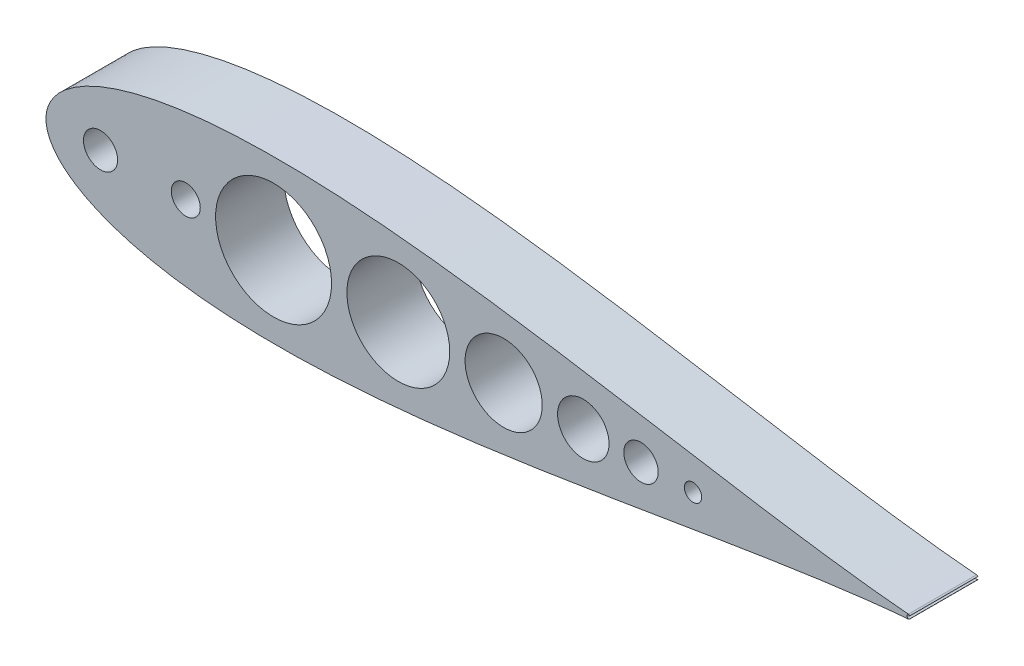
ISO-10303-21;
HEADER;
FILE_DESCRIPTION(('STEP AP214'),'2;1');
FILE_NAME('part.step','',(''),(''),'','','');
FILE_SCHEMA(('AUTOMOTIVE_DESIGN { 1 0 10303 214 1 1 1 1 }'));
ENDSEC;
DATA;
#1=APPLICATION_CONTEXT('core data for automotive mechanical design processes');
#2=APPLICATION_PROTOCOL_DEFINITION('international standard','automotive_design',2000,#1);
#3=PRODUCT_CONTEXT('',#1,'mechanical');
#4=PRODUCT('Part','Part','',(#3));
#5=PRODUCT_RELATED_PRODUCT_CATEGORY('part','',(#4));
#6=PRODUCT_DEFINITION_FORMATION('','',#4);
#7=PRODUCT_DEFINITION_CONTEXT('part definition',#1,'design');
#8=PRODUCT_DEFINITION('design','',#6,#7);
#9=PRODUCT_DEFINITION_SHAPE('','',#8);
#10=(LENGTH_UNIT() NAMED_UNIT(*) SI_UNIT(.MILLI.,.METRE.));
#11=(NAMED_UNIT(*) PLANE_ANGLE_UNIT() SI_UNIT($,.RADIAN.));
#12=(NAMED_UNIT(*) SI_UNIT($,.STERADIAN.) SOLID_ANGLE_UNIT());
#13=UNCERTAINTY_MEASURE_WITH_UNIT(LENGTH_MEASURE(1.E-05),#10,'distance_accuracy_value','');
#14=(GEOMETRIC_REPRESENTATION_CONTEXT(3) GLOBAL_UNCERTAINTY_ASSIGNED_CONTEXT((#13)) GLOBAL_UNIT_ASSIGNED_CONTEXT((#10,
#11,#12)) REPRESENTATION_CONTEXT('',''));
#15=CARTESIAN_POINT('',(0.,0.,0.));
#16=DIRECTION('',(0.,0.,1.));
#17=DIRECTION('',(1.,0.,0.));
#18=AXIS2_PLACEMENT_3D('',#15,#16,#17);
#19=CARTESIAN_POINT('',(670.559999999999,0.,50.7999999999997));
#20=CARTESIAN_POINT('',(670.559999999999,0.015678594926758,50.7999999999997));
#21=CARTESIAN_POINT('',(666.344759682884,0.0546967077379723,50.7999999999997));
#22=CARTESIAN_POINT('',(662.850933167966,0.234427605388388,50.7999999999997));
#23=CARTESIAN_POINT('',(656.504964310748,0.543558382914533,50.7999999999997));
#24=CARTESIAN_POINT('',(649.29295176402,1.03477125279453,50.7999999999997));
#25=CARTESIAN_POINT('',(640.49155963975,1.7319195784182,50.7999999999997));
#26=CARTESIAN_POINT('',(630.413817461935,2.66338549322032,50.7999999999997));
#27=CARTESIAN_POINT('',(619.014124193101,3.8492536640852,50.7999999999997));
#28=CARTESIAN_POINT('',(606.374988512379,5.30442898343114,50.7999999999997));
#29=CARTESIAN_POINT('',(592.543922516217,7.03763490710044,50.7999999999997));
#30=CARTESIAN_POINT('',(577.585454095337,9.05063614704171,50.7999999999997));
#31=CARTESIAN_POINT('',(561.564270734498,11.3389196249111,50.7999999999997));
#32=CARTESIAN_POINT('',(544.549749945782,13.890665374914,50.7999999999997));
#33=CARTESIAN_POINT('',(526.614143657614,16.6877207529689,50.7999999999997));
#34=CARTESIAN_POINT('',(507.832591566438,19.7051116629439,50.7999999999997));
#35=CARTESIAN_POINT('',(488.28271028846,22.9116726009049,50.7999999999997));
#36=CARTESIAN_POINT('',(468.04436773457,26.2704360601483,50.7999999999997));
#37=CARTESIAN_POINT('',(447.199424328287,29.7390074319527,50.7999999999997));
#38=CARTESIAN_POINT('',(425.831595832133,33.2703241206413,50.7999999999997));
#39=CARTESIAN_POINT('',(404.026315660115,36.8132205450789,50.7999999999997));
#40=CARTESIAN_POINT('',(381.870662855574,40.3132668564463,50.7999999999997));
#41=CARTESIAN_POINT('',(359.45331489519,43.7135025323023,50.7999999999997));
#42=CARTESIAN_POINT('',(336.864544150043,46.9554474567625,50.7999999999997));
#43=CARTESIAN_POINT('',(314.196207315012,49.9798438951445,50.7999999999997));
#44=CARTESIAN_POINT('',(291.541767703989,52.7277127038915,50.7999999999997));
#45=CARTESIAN_POINT('',(268.996310773138,55.1412010116264,50.7999999999997));
#46=CARTESIAN_POINT('',(246.656558649997,57.1646038288049,50.7999999999997));
#47=CARTESIAN_POINT('',(224.620860897201,58.7451766411795,50.7999999999997));
#48=CARTESIAN_POINT('',(202.989192599403,59.8341217002376,50.7999999999997));
#49=CARTESIAN_POINT('',(181.863132616042,60.3875061421198,50.7999999999997));
#50=CARTESIAN_POINT('',(161.345829026568,60.3669613241371,50.7999999999997));
#51=CARTESIAN_POINT('',(141.542033827972,59.7398958243376,50.7999999999997));
#52=CARTESIAN_POINT('',(122.558104572901,58.4817581038393,50.7999999999997));
#53=CARTESIAN_POINT('',(104.502313427195,56.5743039322431,50.7999999999997));
#54=CARTESIAN_POINT('',(87.4850186361544,54.0089351991652,50.7999999999997));
#55=CARTESIAN_POINT('',(71.6196960831897,50.7847520029955,50.7999999999997));
#56=CARTESIAN_POINT('',(57.0237097246997,46.9125430655856,50.7999999999997));
#57=CARTESIAN_POINT('',(43.8204543300274,42.4150024601014,50.7999999999997));
#58=CARTESIAN_POINT('',(32.1416452388822,37.332204028646,50.7999999999997));
#59=CARTESIAN_POINT('',(22.1291073753192,31.7314553388244,50.7999999999997));
#60=CARTESIAN_POINT('',(13.932423523913,25.7264121059534,50.7999999999997));
#61=CARTESIAN_POINT('',(7.68961648909829,19.5132076319134,50.7999999999997));
#62=CARTESIAN_POINT('',(3.46313634309123,13.4203544206608,50.7999999999997));
#63=CARTESIAN_POINT('',(1.10633322756691,7.92338943472258,50.7999999999997));
#64=CARTESIAN_POINT('',(0.154611581573635,3.51379661507278,50.7999999999997));
#65=CARTESIAN_POINT('',(-0.0621515976067938,1.11022302462516E-13,50.7999999999997));
#66=CARTESIAN_POINT('',(0.154611581573594,-3.51379661507323,50.7999999999997));
#67=CARTESIAN_POINT('',(1.10633322756683,-7.92338943472273,50.7999999999997));
#68=CARTESIAN_POINT('',(3.46313634309116,-13.4203544206611,50.7999999999997));
#69=CARTESIAN_POINT('',(7.68961648909822,-19.5132076319135,50.7999999999997));
#70=CARTESIAN_POINT('',(13.932423523913,-25.7264121059536,50.7999999999997));
#71=CARTESIAN_POINT('',(22.1291073753193,-31.7314553388246,50.7999999999997));
#72=CARTESIAN_POINT('',(32.141645238882,-37.3322040286461,50.7999999999997));
#73=CARTESIAN_POINT('',(43.8204543300276,-42.4150024601016,50.7999999999997));
#74=CARTESIAN_POINT('',(57.0237097246996,-46.9125430655858,50.7999999999997));
#75=CARTESIAN_POINT('',(71.6196960831898,-50.7847520029957,50.7999999999997));
#76=CARTESIAN_POINT('',(87.4850186361543,-54.0089351991654,50.7999999999997));
#77=CARTESIAN_POINT('',(104.502313427195,-56.5743039322433,50.7999999999997));
#78=CARTESIAN_POINT('',(122.558104572901,-58.4817581038393,50.7999999999997));
#79=CARTESIAN_POINT('',(141.542033827972,-59.7398958243377,50.7999999999997));
#80=CARTESIAN_POINT('',(161.345829026568,-60.366961324137,50.7999999999997));
#81=CARTESIAN_POINT('',(181.863132616042,-60.38750614212,50.7999999999997));
#82=CARTESIAN_POINT('',(202.989192599403,-59.8341217002377,50.7999999999997));
#83=CARTESIAN_POINT('',(224.6208608972,-58.7451766411795,50.7999999999997));
#84=CARTESIAN_POINT('',(246.656558649997,-57.1646038288049,50.7999999999997));
#85=CARTESIAN_POINT('',(268.996310773137,-55.1412010116263,50.7999999999997));
#86=CARTESIAN_POINT('',(291.541767703989,-52.7277127038914,50.7999999999997));
#87=CARTESIAN_POINT('',(314.196207315012,-49.9798438951445,50.7999999999997));
#88=CARTESIAN_POINT('',(336.864544150043,-46.9554474567625,50.7999999999997));
#89=CARTESIAN_POINT('',(359.45331489519,-43.7135025323023,50.7999999999997));
#90=CARTESIAN_POINT('',(381.870662855574,-40.3132668564459,50.7999999999997));
#91=CARTESIAN_POINT('',(404.026315660115,-36.8132205450789,50.7999999999997));
#92=CARTESIAN_POINT('',(425.831595832133,-33.2703241206413,50.7999999999997));
#93=CARTESIAN_POINT('',(447.199424328287,-29.7390074319527,50.7999999999997));
#94=CARTESIAN_POINT('',(468.04436773457,-26.2704360601484,50.7999999999997));
#95=CARTESIAN_POINT('',(488.28271028846,-22.911672600905,50.7999999999997));
#96=CARTESIAN_POINT('',(507.832591566438,-19.7051116629441,50.7999999999997));
#97=CARTESIAN_POINT('',(526.614143657613,-16.687720752969,50.7999999999997));
#98=CARTESIAN_POINT('',(544.549749945782,-13.8906653749145,50.7999999999997));
#99=CARTESIAN_POINT('',(561.564270734499,-11.3389196249109,50.7999999999997));
#100=CARTESIAN_POINT('',(577.585454095336,-9.05063614704174,50.7999999999997));
#101=CARTESIAN_POINT('',(592.543922516216,-7.03763490710049,50.7999999999997));
#102=CARTESIAN_POINT('',(606.37498851238,-5.3044289834312,50.7999999999997));
#103=CARTESIAN_POINT('',(619.014124193101,-3.84925366408523,50.7999999999997));
#104=CARTESIAN_POINT('',(630.413817461935,-2.66338549322043,50.7999999999997));
#105=CARTESIAN_POINT('',(640.491559639751,-1.73191957841817,50.7999999999997));
#106=CARTESIAN_POINT('',(649.29295176402,-1.03477125279466,50.7999999999997));
#107=CARTESIAN_POINT('',(656.504964310748,-0.543558382914894,50.7999999999997));
#108=CARTESIAN_POINT('',(662.850933167966,-0.234427605388915,50.7999999999997));
#109=CARTESIAN_POINT('',(666.344759682884,-0.0546967077380001,50.7999999999997));
#110=CARTESIAN_POINT('',(670.559999999999,-0.0156785949268456,50.7999999999997));
#111=CARTESIAN_POINT('',(670.559999999999,0.,50.7999999999997));
#112=B_SPLINE_CURVE_WITH_KNOTS('',3,(#19,#20,#21,#22,#23,#24,#25,#26,#27,#28,#29,#30,#31,#32,
#33,#34,#35,#36,#37,#38,#39,#40,#41,#42,#43,#44,#45,#46,#47,#48,#49,#50,#51,#52,#53,#54,#55,#56,
#57,#58,#59,#60,#61,#62,#63,#64,#65,#66,#67,#68,#69,#70,#71,#72,#73,#74,#75,#76,#77,#78,#79,#80,
#81,#82,#83,#84,#85,#86,#87,#88,#89,#90,#91,#92,#93,#94,#95,#96,#97,#98,#99,#100,#101,#102,#103,
#104,#105,#106,#107,#108,#109,#110,#111),.UNSPECIFIED.,.T.,.F.,(4,1,1,1,1,1,1,1,1,1,1,1,1,1,1,1,
1,1,1,1,1,1,1,1,1,1,1,1,1,1,1,1,1,1,1,1,1,1,1,1,1,1,1,1,1,1,1,1,1,1,1,1,1,1,1,1,1,1,1,1,1,1,1,1,
1,1,1,1,1,1,1,1,1,1,1,1,1,1,1,1,1,1,1,1,1,1,1,1,1,1,4),(0.,0.00216777795588342,
0.00539478220000884,0.00966720698444134,0.0149667883303173,0.0212708876900959,
0.0285525550130683,0.0367806836725549,0.0459201019032637,0.0559317636633187,0.0667728836144854,
0.0783971303496518,0.0907548266908363,0.103793164577546,0.117456431914319,0.131686225652521,
0.146421738497113,0.161599998000845,0.177156132626574,0.193023668070302,0.209134785631037,
0.225420632511523,0.241811601924249,0.258237646860869,0.274628556698349,0.290914287398014,
0.307025228908797,0.322892517177238,0.33844834182358,0.353626206573582,0.368361231970712,
0.382590427827798,0.396252960572084,0.40929041186716,0.421647009590256,0.433269881487031,
0.444109248914041,0.454118639688981,0.463255054987312,0.471479113777303,0.478755288570903,
0.485052318112802,0.490344025694165,0.494609832614287,0.497833231437255,0.5,0.502166768562745,
0.505390167385713,0.509655974305835,0.514947681887198,0.521244711429097,0.528520886222697,
0.536744945012688,0.545881360311019,0.555890751085959,0.566730118512969,0.578352990409744,
0.59070958813284,0.603747039427916,0.617409572172202,0.631638768029288,0.646373793426418,
0.66155165817642,0.677107482822761,0.692974771091203,0.709085712601986,0.725371443301651,
0.741762353139131,0.758188398075751,0.774579367488477,0.790865214368963,0.806976331929698,
0.822843867373426,0.838400001999155,0.853578261502887,0.868313774347479,0.882543568085681,
0.896206835422454,0.909245173309164,0.921602869650348,0.933227116385514,0.944068236336681,
0.954079898096736,0.963219316327445,0.971447444986932,0.978729112309904,0.985033211669683,
0.990332793015559,0.994605217799991,0.997832222044117,1.),.UNSPECIFIED.);
#113=DIRECTION('',(0.,0.,-1.));
#114=VECTOR('',#113,1.);
#115=SURFACE_OF_LINEAR_EXTRUSION('',#112,#114);
#116=CARTESIAN_POINT('',(670.559999999999,0.,0.));
#117=CARTESIAN_POINT('',(670.559999999999,0.015678594926758,0.));
#118=CARTESIAN_POINT('',(666.344759682884,0.0546967077379723,0.));
#119=CARTESIAN_POINT('',(662.850933167966,0.234427605388388,0.));
#120=CARTESIAN_POINT('',(656.504964310748,0.543558382914533,0.));
#121=CARTESIAN_POINT('',(649.29295176402,1.03477125279453,0.));
#122=CARTESIAN_POINT('',(640.49155963975,1.7319195784182,0.));
#123=CARTESIAN_POINT('',(630.413817461935,2.66338549322032,0.));
#124=CARTESIAN_POINT('',(619.014124193101,3.8492536640852,0.));
#125=CARTESIAN_POINT('',(606.374988512379,5.30442898343114,0.));
#126=CARTESIAN_POINT('',(592.543922516217,7.03763490710044,0.));
#127=CARTESIAN_POINT('',(577.585454095337,9.05063614704171,0.));
#128=CARTESIAN_POINT('',(561.564270734498,11.3389196249111,0.));
#129=CARTESIAN_POINT('',(544.549749945782,13.890665374914,0.));
#130=CARTESIAN_POINT('',(526.614143657614,16.6877207529689,0.));
#131=CARTESIAN_POINT('',(507.832591566438,19.7051116629439,0.));
#132=CARTESIAN_POINT('',(488.28271028846,22.9116726009049,0.));
#133=CARTESIAN_POINT('',(468.04436773457,26.2704360601483,0.));
#134=CARTESIAN_POINT('',(447.199424328287,29.7390074319527,0.));
#135=CARTESIAN_POINT('',(425.831595832133,33.2703241206413,0.));
#136=CARTESIAN_POINT('',(404.026315660115,36.8132205450789,0.));
#137=CARTESIAN_POINT('',(381.870662855574,40.3132668564463,0.));
#138=CARTESIAN_POINT('',(359.45331489519,43.7135025323023,0.));
#139=CARTESIAN_POINT('',(336.864544150043,46.9554474567625,0.));
#140=CARTESIAN_POINT('',(314.196207315012,49.9798438951445,0.));
#141=CARTESIAN_POINT('',(291.541767703989,52.7277127038915,0.));
#142=CARTESIAN_POINT('',(268.996310773138,55.1412010116264,0.));
#143=CARTESIAN_POINT('',(246.656558649997,57.1646038288049,0.));
#144=CARTESIAN_POINT('',(224.6208608972,58.7451766411796,0.));
#145=CARTESIAN_POINT('',(202.989192599403,59.8341217002378,0.));
#146=CARTESIAN_POINT('',(181.863132616042,60.38750614212,0.));
#147=CARTESIAN_POINT('',(161.345829026567,60.3669613241369,0.));
#148=CARTESIAN_POINT('',(141.542033827972,59.7398958243375,0.));
#149=CARTESIAN_POINT('',(122.558104572901,58.4817581038392,0.));
#150=CARTESIAN_POINT('',(104.502313427195,56.5743039322431,0.));
#151=CARTESIAN_POINT('',(87.4850186361545,54.0089351991652,0.));
#152=CARTESIAN_POINT('',(71.6196960831898,50.7847520029956,0.));
#153=CARTESIAN_POINT('',(57.0237097246998,46.9125430655857,0.));
#154=CARTESIAN_POINT('',(43.8204543300276,42.4150024601015,0.));
#155=CARTESIAN_POINT('',(32.1416452388822,37.332204028646,0.));
#156=CARTESIAN_POINT('',(22.1291073753192,31.7314553388243,0.));
#157=CARTESIAN_POINT('',(13.932423523913,25.7264121059534,0.));
#158=CARTESIAN_POINT('',(7.68961648909831,19.5132076319133,0.));
#159=CARTESIAN_POINT('',(3.46313634309121,13.4203544206609,0.));
#160=CARTESIAN_POINT('',(1.10633322756684,7.92338943472271,0.));
#161=CARTESIAN_POINT('',(0.154611581573608,3.51379661507287,0.));
#162=CARTESIAN_POINT('',(-0.062151597606766,1.52655665885959E-13,0.));
#163=CARTESIAN_POINT('',(0.154611581573691,-3.51379661507319,0.));
#164=CARTESIAN_POINT('',(1.10633322756683,-7.92338943472272,0.));
#165=CARTESIAN_POINT('',(3.46313634309127,-13.420354420661,0.));
#166=CARTESIAN_POINT('',(7.68961648909823,-19.5132076319135,0.));
#167=CARTESIAN_POINT('',(13.9324235239131,-25.7264121059535,0.));
#168=CARTESIAN_POINT('',(22.1291073753193,-31.7314553388246,0.));
#169=CARTESIAN_POINT('',(32.1416452388822,-37.3322040286461,0.));
#170=CARTESIAN_POINT('',(43.8204543300276,-42.4150024601017,0.));
#171=CARTESIAN_POINT('',(57.0237097246998,-46.9125430655859,0.));
#172=CARTESIAN_POINT('',(71.6196960831898,-50.7847520029958,0.));
#173=CARTESIAN_POINT('',(87.4850186361545,-54.0089351991654,0.));
#174=CARTESIAN_POINT('',(104.502313427195,-56.5743039322434,0.));
#175=CARTESIAN_POINT('',(122.558104572901,-58.4817581038394,0.));
#176=CARTESIAN_POINT('',(141.542033827972,-59.7398958243377,0.));
#177=CARTESIAN_POINT('',(161.345829026568,-60.3669613241371,0.));
#178=CARTESIAN_POINT('',(181.863132616042,-60.38750614212,0.));
#179=CARTESIAN_POINT('',(202.989192599403,-59.8341217002378,0.));
#180=CARTESIAN_POINT('',(224.620860897201,-58.7451766411796,0.));
#181=CARTESIAN_POINT('',(246.656558649997,-57.1646038288049,0.));
#182=CARTESIAN_POINT('',(268.996310773137,-55.1412010116263,0.));
#183=CARTESIAN_POINT('',(291.541767703989,-52.7277127038914,0.));
#184=CARTESIAN_POINT('',(314.196207315012,-49.9798438951445,0.));
#185=CARTESIAN_POINT('',(336.864544150043,-46.9554474567625,0.));
#186=CARTESIAN_POINT('',(359.45331489519,-43.7135025323023,0.));
#187=CARTESIAN_POINT('',(381.870662855574,-40.3132668564459,0.));
#188=CARTESIAN_POINT('',(404.026315660115,-36.8132205450789,0.));
#189=CARTESIAN_POINT('',(425.831595832133,-33.2703241206413,0.));
#190=CARTESIAN_POINT('',(447.199424328287,-29.7390074319527,0.));
#191=CARTESIAN_POINT('',(468.04436773457,-26.2704360601484,0.));
#192=CARTESIAN_POINT('',(488.28271028846,-22.911672600905,0.));
#193=CARTESIAN_POINT('',(507.832591566438,-19.7051116629441,0.));
#194=CARTESIAN_POINT('',(526.614143657613,-16.687720752969,0.));
#195=CARTESIAN_POINT('',(544.549749945782,-13.8906653749145,0.));
#196=CARTESIAN_POINT('',(561.564270734499,-11.3389196249109,0.));
#197=CARTESIAN_POINT('',(577.585454095336,-9.05063614704174,0.));
#198=CARTESIAN_POINT('',(592.543922516216,-7.03763490710049,0.));
#199=CARTESIAN_POINT('',(606.37498851238,-5.3044289834312,0.));
#200=CARTESIAN_POINT('',(619.014124193101,-3.84925366408523,0.));
#201=CARTESIAN_POINT('',(630.413817461935,-2.66338549322043,0.));
#202=CARTESIAN_POINT('',(640.491559639751,-1.73191957841817,0.));
#203=CARTESIAN_POINT('',(649.29295176402,-1.03477125279466,0.));
#204=CARTESIAN_POINT('',(656.504964310748,-0.543558382914894,0.));
#205=CARTESIAN_POINT('',(662.850933167966,-0.234427605388915,0.));
#206=CARTESIAN_POINT('',(666.344759682884,-0.0546967077380001,0.));
#207=CARTESIAN_POINT('',(670.559999999999,-0.0156785949268456,0.));
#208=CARTESIAN_POINT('',(670.559999999999,0.,0.));
#209=B_SPLINE_CURVE_WITH_KNOTS('',3,(#116,#117,#118,#119,#120,#121,#122,#123,#124,#125,#126,
#127,#128,#129,#130,#131,#132,#133,#134,#135,#136,#137,#138,#139,#140,#141,#142,#143,#144,#145,
#146,#147,#148,#149,#150,#151,#152,#153,#154,#155,#156,#157,#158,#159,#160,#161,#162,#163,#164,
#165,#166,#167,#168,#169,#170,#171,#172,#173,#174,#175,#176,#177,#178,#179,#180,#181,#182,#183,
#184,#185,#186,#187,#188,#189,#190,#191,#192,#193,#194,#195,#196,#197,#198,#199,#200,#201,#202,
#203,#204,#205,#206,#207,#208),.UNSPECIFIED.,.T.,.F.,(4,1,1,1,1,1,1,1,1,1,1,1,1,1,1,1,1,1,1,1,1,
1,1,1,1,1,1,1,1,1,1,1,1,1,1,1,1,1,1,1,1,1,1,1,1,1,1,1,1,1,1,1,1,1,1,1,1,1,1,1,1,1,1,1,1,1,1,1,1,
1,1,1,1,1,1,1,1,1,1,1,1,1,1,1,1,1,1,1,1,1,4),(0.,0.00216777795588342,0.00539478220000884,
0.00966720698444134,0.0149667883303173,0.0212708876900959,0.0285525550130683,0.0367806836725549,
0.0459201019032637,0.0559317636633187,0.0667728836144854,0.0783971303496518,0.0907548266908363,
0.103793164577546,0.117456431914319,0.131686225652521,0.146421738497113,0.161599998000845,
0.177156132626574,0.193023668070302,0.209134785631037,0.225420632511523,0.241811601924249,
0.258237646860869,0.274628556698349,0.290914287398014,0.307025228908797,0.322892517177238,
0.33844834182358,0.353626206573582,0.368361231970712,0.382590427827798,0.396252960572084,
0.40929041186716,0.421647009590256,0.433269881487031,0.444109248914041,0.454118639688981,
0.463255054987312,0.471479113777303,0.478755288570903,0.485052318112802,0.490344025694165,
0.494609832614287,0.497833231437255,0.5,0.502166768562745,0.505390167385713,0.509655974305835,
0.514947681887198,0.521244711429097,0.528520886222697,0.536744945012688,0.545881360311019,
0.555890751085959,0.566730118512969,0.578352990409744,0.59070958813284,0.603747039427916,
0.617409572172202,0.631638768029288,0.646373793426418,0.66155165817642,0.677107482822761,
0.692974771091203,0.709085712601986,0.725371443301651,0.741762353139131,0.758188398075751,
0.774579367488477,0.790865214368963,0.806976331929698,0.822843867373426,0.838400001999155,
0.853578261502887,0.868313774347479,0.882543568085681,0.896206835422454,0.909245173309164,
0.921602869650348,0.933227116385514,0.944068236336681,0.954079898096736,0.963219316327445,
0.971447444986932,0.978729112309904,0.985033211669683,0.990332793015559,0.994605217799991,
0.997832222044117,1.),.UNSPECIFIED.);
#210=CARTESIAN_POINT('',(642.510849283043,1.58203911233976,0.));
#211=VERTEX_POINT('',#210);
#212=CARTESIAN_POINT('',(642.510849283043,-1.58203911233976,0.));
#213=VERTEX_POINT('',#212);
#214=EDGE_CURVE('E95',#211,#213,#209,.T.);
#215=ORIENTED_EDGE('',*,*,#214,.T.);
#216=DIRECTION('',(0.,0.,-1.));
#217=VECTOR('',#216,1.);
#218=CARTESIAN_POINT('',(642.510849283043,-1.58203911233976,50.7999999999997));
#219=LINE('',#218,#217);
#220=CARTESIAN_POINT('',(642.510849283043,-1.58203911233976,50.7999999999997));
#221=VERTEX_POINT('',#220);
#222=EDGE_CURVE('E13',#221,#213,#219,.T.);
#223=ORIENTED_EDGE('',*,*,#222,.F.);
#224=CARTESIAN_POINT('',(642.510849283043,1.58203911233976,50.7999999999997));
#225=VERTEX_POINT('',#224);
#226=EDGE_CURVE('E102',#225,#221,#112,.T.);
#227=ORIENTED_EDGE('',*,*,#226,.F.);
#228=DIRECTION('',(0.,0.,-1.));
#229=VECTOR('',#228,1.);
#230=CARTESIAN_POINT('',(642.510849283043,1.58203911233976,50.7999999999997));
#231=LINE('',#230,#229);
#232=EDGE_CURVE('E121',#225,#211,#231,.T.);
#233=ORIENTED_EDGE('',*,*,#232,.T.);
#234=EDGE_LOOP('',(#215,#223,#227,#233));
#235=FACE_BOUND('',#234,.T.);
#236=ADVANCED_FACE('F58',(#235),#115,.F.);
#237=CARTESIAN_POINT('',(642.379287521777,0.,50.7999999999997));
#238=DIRECTION('',(0.,0.,-1.));
#239=DIRECTION('',(-0.999999999999998,0.,0.));
#240=AXIS2_PLACEMENT_3D('',#237,#238,#239);
#241=CYLINDRICAL_SURFACE('',#240,1.58750000000001);
#242=CARTESIAN_POINT('',(642.379287521777,0.,0.));
#243=DIRECTION('',(0.,0.,1.));
#244=DIRECTION('',(0.999999999999998,0.,0.));
#245=AXIS2_PLACEMENT_3D('',#242,#243,#244);
#246=CIRCLE('',#245,1.58750000000001);
#247=CARTESIAN_POINT('',(643.599082689009,-1.01599999999991,0.));
#248=VERTEX_POINT('',#247);
#249=EDGE_CURVE('E117',#213,#248,#246,.T.);
#250=ORIENTED_EDGE('',*,*,#249,.T.);
#251=DIRECTION('',(0.,0.,-1.));
#252=VECTOR('',#251,1.);
#253=CARTESIAN_POINT('',(643.599082689009,-1.01599999999991,50.7999999999997));
#254=LINE('',#253,#252);
#255=CARTESIAN_POINT('',(643.599082689009,-1.01599999999991,50.7999999999997));
#256=VERTEX_POINT('',#255);
#257=EDGE_CURVE('E69',#256,#248,#254,.T.);
#258=ORIENTED_EDGE('',*,*,#257,.F.);
#259=CARTESIAN_POINT('',(642.379287521777,0.,50.7999999999997));
#260=DIRECTION('',(0.,0.,1.));
#261=DIRECTION('',(0.999999999999998,0.,0.));
#262=AXIS2_PLACEMENT_3D('',#259,#260,#261);
#263=CIRCLE('',#262,1.58750000000001);
#264=EDGE_CURVE('E81',#221,#256,#263,.T.);
#265=ORIENTED_EDGE('',*,*,#264,.F.);
#266=ORIENTED_EDGE('',*,*,#222,.T.);
#267=EDGE_LOOP('',(#250,#258,#265,#266));
#268=FACE_BOUND('',#267,.T.);
#269=ADVANCED_FACE('F241',(#268),#241,.T.);
#270=CARTESIAN_POINT('',(642.837082689008,0.,50.7999999999997));
#271=DIRECTION('',(0.,0.,-1.));
#272=DIRECTION('',(-0.999999999999998,0.,0.));
#273=AXIS2_PLACEMENT_3D('',#270,#271,#272);
#274=CYLINDRICAL_SURFACE('',#273,1.26999999999999);
#275=CARTESIAN_POINT('',(642.837082689008,0.,0.));
#276=DIRECTION('',(0.,0.,1.));
#277=DIRECTION('',(0.999999999999998,0.,0.));
#278=AXIS2_PLACEMENT_3D('',#275,#276,#277);
#279=CIRCLE('',#278,1.26999999999999);
#280=CARTESIAN_POINT('',(643.599082689008,1.01599999999988,0.));
#281=VERTEX_POINT('',#280);
#282=EDGE_CURVE('E169',#281,#248,#279,.T.);
#283=ORIENTED_EDGE('',*,*,#282,.F.);
#284=DIRECTION('',(0.,0.,-1.));
#285=VECTOR('',#284,1.);
#286=CARTESIAN_POINT('',(643.599082689008,1.01599999999988,50.7999999999997));
#287=LINE('',#286,#285);
#288=CARTESIAN_POINT('',(643.599082689008,1.01599999999988,50.7999999999997));
#289=VERTEX_POINT('',#288);
#290=EDGE_CURVE('E126',#289,#281,#287,.T.);
#291=ORIENTED_EDGE('',*,*,#290,.F.);
#292=CARTESIAN_POINT('',(642.837082689008,0.,50.7999999999997));
#293=DIRECTION('',(0.,0.,1.));
#294=DIRECTION('',(0.999999999999998,0.,0.));
#295=AXIS2_PLACEMENT_3D('',#292,#293,#294);
#296=CIRCLE('',#295,1.26999999999999);
#297=EDGE_CURVE('E150',#289,#256,#296,.T.);
#298=ORIENTED_EDGE('',*,*,#297,.T.);
#299=ORIENTED_EDGE('',*,*,#257,.T.);
#300=EDGE_LOOP('',(#283,#291,#298,#299));
#301=FACE_BOUND('',#300,.T.);
#302=ADVANCED_FACE('F245',(#301),#274,.F.);
#303=CARTESIAN_POINT('',(104.14,0.,50.7999999999997));
#304=DIRECTION('',(0.,0.,-1.));
#305=DIRECTION('',(-0.999999999999998,0.,0.));
#306=AXIS2_PLACEMENT_3D('',#303,#304,#305);
#307=CYLINDRICAL_SURFACE('',#306,10.795);
#308=CARTESIAN_POINT('',(104.14,0.,0.));
#309=DIRECTION('',(0.,0.,1.));
#310=DIRECTION('',(0.999999999999998,0.,0.));
#311=AXIS2_PLACEMENT_3D('',#308,#309,#310);
#312=CIRCLE('',#311,10.795);
#313=CARTESIAN_POINT('',(114.935,0.,0.));
#314=VERTEX_POINT('',#313);
#315=EDGE_CURVE('E172',#314,#314,#312,.T.);
#316=ORIENTED_EDGE('',*,*,#315,.F.);
#317=EDGE_LOOP('',(#316));
#318=FACE_BOUND('',#317,.T.);
#319=CARTESIAN_POINT('',(104.14,0.,50.7999999999997));
#320=DIRECTION('',(0.,0.,1.));
#321=DIRECTION('',(0.999999999999998,0.,0.));
#322=AXIS2_PLACEMENT_3D('',#319,#320,#321);
#323=CIRCLE('',#322,10.795);
#324=CARTESIAN_POINT('',(114.935,0.,50.7999999999997));
#325=VERTEX_POINT('',#324);
#326=EDGE_CURVE('E154',#325,#325,#323,.T.);
#327=ORIENTED_EDGE('',*,*,#326,.T.);
#328=EDGE_LOOP('',(#327));
#329=FACE_BOUND('',#328,.T.);
#330=ADVANCED_FACE('F250',(#318,#329),#307,.F.);
#331=CARTESIAN_POINT('',(40.6399999999999,-1.42247325030098E-13,50.7999999999997));
#332=DIRECTION('',(0.,0.,-1.));
#333=DIRECTION('',(-0.999999999999998,0.,0.));
#334=AXIS2_PLACEMENT_3D('',#331,#332,#333);
#335=CYLINDRICAL_SURFACE('',#334,12.7);
#336=CARTESIAN_POINT('',(40.6399999999999,-1.59594559789866E-13,0.));
#337=DIRECTION('',(0.,0.,1.));
#338=DIRECTION('',(0.999999999999998,0.,0.));
#339=AXIS2_PLACEMENT_3D('',#336,#337,#338);
#340=CIRCLE('',#339,12.7);
#341=CARTESIAN_POINT('',(53.3399999999999,-1.6100454303114E-13,0.));
#342=VERTEX_POINT('',#341);
#343=EDGE_CURVE('E144',#342,#342,#340,.T.);
#344=ORIENTED_EDGE('',*,*,#343,.F.);
#345=EDGE_LOOP('',(#344));
#346=FACE_BOUND('',#345,.T.);
#347=CARTESIAN_POINT('',(40.6399999999999,-1.42247325030098E-13,50.7999999999997));
#348=DIRECTION('',(0.,0.,1.));
#349=DIRECTION('',(0.999999999999998,0.,0.));
#350=AXIS2_PLACEMENT_3D('',#347,#348,#349);
#351=CIRCLE('',#350,12.7);
#352=CARTESIAN_POINT('',(53.3399999999999,-1.43657308271372E-13,50.7999999999997));
#353=VERTEX_POINT('',#352);
#354=EDGE_CURVE('E158',#353,#353,#351,.T.);
#355=ORIENTED_EDGE('',*,*,#354,.T.);
#356=EDGE_LOOP('',(#355));
#357=FACE_BOUND('',#356,.T.);
#358=ADVANCED_FACE('F256',(#346,#357),#335,.F.);
#359=CARTESIAN_POINT('',(0.,0.,50.7999999999997));
#360=DIRECTION('',(0.,0.,1.));
#361=DIRECTION('',(0.999999999999998,0.,0.));
#362=AXIS2_PLACEMENT_3D('',#359,#360,#361);
#363=PLANE('',#362);
#364=ORIENTED_EDGE('',*,*,#354,.F.);
#365=EDGE_LOOP('',(#364));
#366=FACE_BOUND('',#365,.T.);
#367=ORIENTED_EDGE('',*,*,#326,.F.);
#368=EDGE_LOOP('',(#367));
#369=FACE_BOUND('',#368,.T.);
#370=ORIENTED_EDGE('',*,*,#297,.F.);
#371=CARTESIAN_POINT('',(642.379287521777,0.,50.7999999999997));
#372=DIRECTION('',(0.,0.,-1.));
#373=DIRECTION('',(0.999999999999998,0.,0.));
#374=AXIS2_PLACEMENT_3D('',#371,#372,#373);
#375=CIRCLE('',#374,1.58750000000001);
#376=EDGE_CURVE('E127',#225,#289,#375,.T.);
#377=ORIENTED_EDGE('',*,*,#376,.F.);
#378=ORIENTED_EDGE('',*,*,#226,.T.);
#379=ORIENTED_EDGE('',*,*,#264,.T.);
#380=EDGE_LOOP('',(#370,#377,#378,#379));
#381=FACE_BOUND('',#380,.T.);
#382=CARTESIAN_POINT('',(482.082534569451,-6.38378239159465E-13,50.7999999999997));
#383=DIRECTION('',(0.,0.,1.));
#384=DIRECTION('',(0.999999999999998,0.,0.));
#385=AXIS2_PLACEMENT_3D('',#382,#383,#384);
#386=CIRCLE('',#385,6.47700000000001);
#387=CARTESIAN_POINT('',(488.559534569451,-6.39097330612515E-13,50.7999999999997));
#388=VERTEX_POINT('',#387);
#389=EDGE_CURVE('E184',#388,#388,#386,.T.);
#390=ORIENTED_EDGE('',*,*,#389,.F.);
#391=EDGE_LOOP('',(#390));
#392=FACE_BOUND('',#391,.T.);
#393=CARTESIAN_POINT('',(443.301866123466,4.85722573273506E-13,50.7999999999997));
#394=DIRECTION('',(0.,0.,1.));
#395=DIRECTION('',(0.999999999999998,0.,0.));
#396=AXIS2_PLACEMENT_3D('',#393,#394,#395);
#397=CIRCLE('',#396,12.827);
#398=CARTESIAN_POINT('',(456.128866123466,4.84298490199819E-13,50.7999999999997));
#399=VERTEX_POINT('',#398);
#400=EDGE_CURVE('E188',#399,#399,#397,.T.);
#401=ORIENTED_EDGE('',*,*,#400,.F.);
#402=EDGE_LOOP('',(#401));
#403=FACE_BOUND('',#402,.T.);
#404=CARTESIAN_POINT('',(400.327663748457,0.,50.7999999999997));
#405=DIRECTION('',(0.,0.,1.));
#406=DIRECTION('',(0.999999999999998,0.,0.));
#407=AXIS2_PLACEMENT_3D('',#404,#405,#406);
#408=CIRCLE('',#407,19.177);
#409=CARTESIAN_POINT('',(419.504663748457,0.,50.7999999999997));
#410=VERTEX_POINT('',#409);
#411=EDGE_CURVE('E193',#410,#410,#408,.T.);
#412=ORIENTED_EDGE('',*,*,#411,.F.);
#413=EDGE_LOOP('',(#412));
#414=FACE_BOUND('',#413,.T.);
#415=CARTESIAN_POINT('',(340.979907753812,0.,50.7999999999997));
#416=DIRECTION('',(0.,0.,1.));
#417=DIRECTION('',(0.999999999999998,0.,0.));
#418=AXIS2_PLACEMENT_3D('',#415,#416,#417);
#419=CIRCLE('',#418,28.7407559946448);
#420=CARTESIAN_POINT('',(369.720663748457,0.,50.7999999999997));
#421=VERTEX_POINT('',#420);
#422=EDGE_CURVE('E197',#421,#421,#419,.T.);
#423=ORIENTED_EDGE('',*,*,#422,.F.);
#424=EDGE_LOOP('',(#423));
#425=FACE_BOUND('',#424,.T.);
#426=CARTESIAN_POINT('',(262.503550953445,0.,50.7999999999997));
#427=DIRECTION('',(0.,0.,1.));
#428=DIRECTION('',(0.999999999999998,0.,0.));
#429=AXIS2_PLACEMENT_3D('',#426,#427,#428);
#430=CIRCLE('',#429,38.3056008057221);
#431=CARTESIAN_POINT('',(300.809151759167,0.,50.7999999999997));
#432=VERTEX_POINT('',#431);
#433=EDGE_CURVE('E201',#432,#432,#430,.T.);
#434=ORIENTED_EDGE('',*,*,#433,.F.);
#435=EDGE_LOOP('',(#434));
#436=FACE_BOUND('',#435,.T.);
#437=CARTESIAN_POINT('',(169.566475073862,0.,50.7999999999997));
#438=DIRECTION('',(0.,0.,1.));
#439=DIRECTION('',(0.999999999999998,0.,0.));
#440=AXIS2_PLACEMENT_3D('',#437,#438,#439);
#441=CIRCLE('',#440,43.2014750738616);
#442=CARTESIAN_POINT('',(212.767950147723,0.,50.7999999999997));
#443=VERTEX_POINT('',#442);
#444=EDGE_CURVE('E119',#443,#443,#441,.T.);
#445=ORIENTED_EDGE('',*,*,#444,.F.);
#446=EDGE_LOOP('',(#445));
#447=FACE_BOUND('',#446,.T.);
#448=ADVANCED_FACE('F260',(#366,#369,#381,#392,#403,#414,#425,#436,#447),#363,.T.);
#449=CARTESIAN_POINT('',(0.,0.,0.));
#450=DIRECTION('',(0.,0.,1.));
#451=DIRECTION('',(0.999999999999998,0.,0.));
#452=AXIS2_PLACEMENT_3D('',#449,#450,#451);
#453=PLANE('',#452);
#454=CARTESIAN_POINT('',(169.566475073861,-1.42247325030098E-13,0.));
#455=DIRECTION('',(0.,0.,1.));
#456=DIRECTION('',(0.999999999999998,0.,0.));
#457=AXIS2_PLACEMENT_3D('',#454,#455,#456);
#458=CIRCLE('',#457,43.2014750738616);
#459=CARTESIAN_POINT('',(212.767950147723,-1.47043652262575E-13,0.));
#460=VERTEX_POINT('',#459);
#461=EDGE_CURVE('E62',#460,#460,#458,.T.);
#462=ORIENTED_EDGE('',*,*,#461,.T.);
#463=EDGE_LOOP('',(#462));
#464=FACE_BOUND('',#463,.T.);
#465=CARTESIAN_POINT('',(262.503550953445,0.,0.));
#466=DIRECTION('',(0.,0.,1.));
#467=DIRECTION('',(0.999999999999998,0.,0.));
#468=AXIS2_PLACEMENT_3D('',#465,#466,#467);
#469=CIRCLE('',#468,38.3056008057221);
#470=CARTESIAN_POINT('',(300.809151759167,0.,0.));
#471=VERTEX_POINT('',#470);
#472=EDGE_CURVE('E189',#471,#471,#469,.T.);
#473=ORIENTED_EDGE('',*,*,#472,.T.);
#474=EDGE_LOOP('',(#473));
#475=FACE_BOUND('',#474,.T.);
#476=CARTESIAN_POINT('',(340.979907753812,0.,0.));
#477=DIRECTION('',(0.,0.,1.));
#478=DIRECTION('',(0.999999999999998,0.,0.));
#479=AXIS2_PLACEMENT_3D('',#476,#477,#478);
#480=CIRCLE('',#479,28.7407559946448);
#481=CARTESIAN_POINT('',(369.720663748457,0.,0.));
#482=VERTEX_POINT('',#481);
#483=EDGE_CURVE('E208',#482,#482,#480,.T.);
#484=ORIENTED_EDGE('',*,*,#483,.T.);
#485=EDGE_LOOP('',(#484));
#486=FACE_BOUND('',#485,.T.);
#487=CARTESIAN_POINT('',(400.327663748457,0.,0.));
#488=DIRECTION('',(0.,0.,1.));
#489=DIRECTION('',(0.999999999999998,0.,0.));
#490=AXIS2_PLACEMENT_3D('',#487,#488,#489);
#491=CIRCLE('',#490,19.177);
#492=CARTESIAN_POINT('',(419.504663748457,0.,0.));
#493=VERTEX_POINT('',#492);
#494=EDGE_CURVE('E212',#493,#493,#491,.T.);
#495=ORIENTED_EDGE('',*,*,#494,.T.);
#496=EDGE_LOOP('',(#495));
#497=FACE_BOUND('',#496,.T.);
#498=CARTESIAN_POINT('',(443.301866123466,4.85722573273506E-13,0.));
#499=DIRECTION('',(0.,0.,1.));
#500=DIRECTION('',(0.999999999999998,0.,0.));
#501=AXIS2_PLACEMENT_3D('',#498,#499,#500);
#502=CIRCLE('',#501,12.827);
#503=CARTESIAN_POINT('',(456.128866123466,4.84298490199819E-13,0.));
#504=VERTEX_POINT('',#503);
#505=EDGE_CURVE('E216',#504,#504,#502,.T.);
#506=ORIENTED_EDGE('',*,*,#505,.T.);
#507=EDGE_LOOP('',(#506));
#508=FACE_BOUND('',#507,.T.);
#509=CARTESIAN_POINT('',(482.082534569451,-6.38378239159465E-13,0.));
#510=DIRECTION('',(0.,0.,1.));
#511=DIRECTION('',(0.999999999999998,0.,0.));
#512=AXIS2_PLACEMENT_3D('',#509,#510,#511);
#513=CIRCLE('',#512,6.47700000000001);
#514=CARTESIAN_POINT('',(488.559534569451,-6.39097330612515E-13,0.));
#515=VERTEX_POINT('',#514);
#516=EDGE_CURVE('E138',#515,#515,#513,.T.);
#517=ORIENTED_EDGE('',*,*,#516,.T.);
#518=EDGE_LOOP('',(#517));
#519=FACE_BOUND('',#518,.T.);
#520=ORIENTED_EDGE('',*,*,#343,.T.);
#521=EDGE_LOOP('',(#520));
#522=FACE_BOUND('',#521,.T.);
#523=ORIENTED_EDGE('',*,*,#315,.T.);
#524=EDGE_LOOP('',(#523));
#525=FACE_BOUND('',#524,.T.);
#526=CARTESIAN_POINT('',(642.379287521777,0.,0.));
#527=DIRECTION('',(0.,0.,-1.));
#528=DIRECTION('',(0.999999999999998,0.,0.));
#529=AXIS2_PLACEMENT_3D('',#526,#527,#528);
#530=CIRCLE('',#529,1.58750000000001);
#531=EDGE_CURVE('E115',#211,#281,#530,.T.);
#532=ORIENTED_EDGE('',*,*,#531,.T.);
#533=ORIENTED_EDGE('',*,*,#282,.T.);
#534=ORIENTED_EDGE('',*,*,#249,.F.);
#535=ORIENTED_EDGE('',*,*,#214,.F.);
#536=EDGE_LOOP('',(#532,#533,#534,#535));
#537=FACE_BOUND('',#536,.T.);
#538=ADVANCED_FACE('F112',(#464,#475,#486,#497,#508,#519,#522,#525,#537),#453,.F.);
#539=CARTESIAN_POINT('',(169.566475073861,-1.42247325030098E-13,0.));
#540=DIRECTION('',(0.,0.,1.));
#541=DIRECTION('',(0.999999999999998,0.,0.));
#542=AXIS2_PLACEMENT_3D('',#539,#540,#541);
#543=CYLINDRICAL_SURFACE('',#542,43.2014750738616);
#544=ORIENTED_EDGE('',*,*,#444,.T.);
#545=EDGE_LOOP('',(#544));
#546=FACE_BOUND('',#545,.T.);
#547=ORIENTED_EDGE('',*,*,#461,.F.);
#548=EDGE_LOOP('',(#547));
#549=FACE_BOUND('',#548,.T.);
#550=ADVANCED_FACE('F228',(#546,#549),#543,.F.);
#551=CARTESIAN_POINT('',(482.082534569451,-6.38378239159465E-13,0.));
#552=DIRECTION('',(0.,0.,1.));
#553=DIRECTION('',(0.999999999999998,0.,0.));
#554=AXIS2_PLACEMENT_3D('',#551,#552,#553);
#555=CYLINDRICAL_SURFACE('',#554,6.47700000000001);
#556=ORIENTED_EDGE('',*,*,#389,.T.);
#557=EDGE_LOOP('',(#556));
#558=FACE_BOUND('',#557,.T.);
#559=ORIENTED_EDGE('',*,*,#516,.F.);
#560=EDGE_LOOP('',(#559));
#561=FACE_BOUND('',#560,.T.);
#562=ADVANCED_FACE('F225',(#558,#561),#555,.F.);
#563=CARTESIAN_POINT('',(443.301866123466,4.85722573273506E-13,0.));
#564=DIRECTION('',(0.,0.,1.));
#565=DIRECTION('',(0.999999999999998,0.,0.));
#566=AXIS2_PLACEMENT_3D('',#563,#564,#565);
#567=CYLINDRICAL_SURFACE('',#566,12.827);
#568=ORIENTED_EDGE('',*,*,#400,.T.);
#569=EDGE_LOOP('',(#568));
#570=FACE_BOUND('',#569,.T.);
#571=ORIENTED_EDGE('',*,*,#505,.F.);
#572=EDGE_LOOP('',(#571));
#573=FACE_BOUND('',#572,.T.);
#574=ADVANCED_FACE('F227',(#570,#573),#567,.F.);
#575=CARTESIAN_POINT('',(400.327663748457,0.,0.));
#576=DIRECTION('',(0.,0.,1.));
#577=DIRECTION('',(0.999999999999998,0.,0.));
#578=AXIS2_PLACEMENT_3D('',#575,#576,#577);
#579=CYLINDRICAL_SURFACE('',#578,19.177);
#580=ORIENTED_EDGE('',*,*,#411,.T.);
#581=EDGE_LOOP('',(#580));
#582=FACE_BOUND('',#581,.T.);
#583=ORIENTED_EDGE('',*,*,#494,.F.);
#584=EDGE_LOOP('',(#583));
#585=FACE_BOUND('',#584,.T.);
#586=ADVANCED_FACE('F235',(#582,#585),#579,.F.);
#587=CARTESIAN_POINT('',(340.979907753812,0.,0.));
#588=DIRECTION('',(0.,0.,1.));
#589=DIRECTION('',(0.999999999999998,0.,0.));
#590=AXIS2_PLACEMENT_3D('',#587,#588,#589);
#591=CYLINDRICAL_SURFACE('',#590,28.7407559946448);
#592=ORIENTED_EDGE('',*,*,#422,.T.);
#593=EDGE_LOOP('',(#592));
#594=FACE_BOUND('',#593,.T.);
#595=ORIENTED_EDGE('',*,*,#483,.F.);
#596=EDGE_LOOP('',(#595));
#597=FACE_BOUND('',#596,.T.);
#598=ADVANCED_FACE('F299',(#594,#597),#591,.F.);
#599=CARTESIAN_POINT('',(262.503550953445,0.,0.));
#600=DIRECTION('',(0.,0.,1.));
#601=DIRECTION('',(0.999999999999998,0.,0.));
#602=AXIS2_PLACEMENT_3D('',#599,#600,#601);
#603=CYLINDRICAL_SURFACE('',#602,38.3056008057221);
#604=ORIENTED_EDGE('',*,*,#433,.T.);
#605=EDGE_LOOP('',(#604));
#606=FACE_BOUND('',#605,.T.);
#607=ORIENTED_EDGE('',*,*,#472,.F.);
#608=EDGE_LOOP('',(#607));
#609=FACE_BOUND('',#608,.T.);
#610=ADVANCED_FACE('F305',(#606,#609),#603,.F.);
#611=CARTESIAN_POINT('',(642.379287521777,0.,50.7999999999997));
#612=DIRECTION('',(0.,0.,-1.));
#613=DIRECTION('',(-0.999999999999998,0.,0.));
#614=AXIS2_PLACEMENT_3D('',#611,#612,#613);
#615=CYLINDRICAL_SURFACE('',#614,1.58750000000001);
#616=ORIENTED_EDGE('',*,*,#531,.F.);
#617=ORIENTED_EDGE('',*,*,#232,.F.);
#618=ORIENTED_EDGE('',*,*,#376,.T.);
#619=ORIENTED_EDGE('',*,*,#290,.T.);
#620=EDGE_LOOP('',(#616,#617,#618,#619));
#621=FACE_BOUND('',#620,.T.);
#622=ADVANCED_FACE('F130',(#621),#615,.T.);
#623=CLOSED_SHELL('',(#236,#269,#302,#330,#358,#448,#538,#550,#562,#574,#586,#598,#610,#622));
#624=MANIFOLD_SOLID_BREP('B2',#623);
#625=ADVANCED_BREP_SHAPE_REPRESENTATION('',(#18,#624),#14);
#626=SHAPE_DEFINITION_REPRESENTATION(#9,#625);
ENDSEC;
END-ISO-10303-21;
